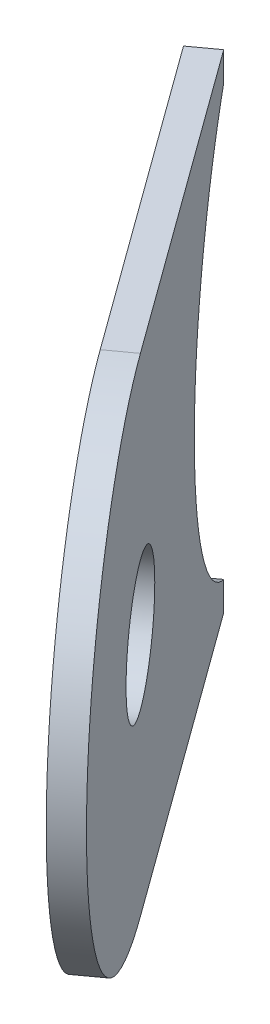
ISO-10303-21;
HEADER;
FILE_DESCRIPTION(('STEP AP214'),'2;1');
FILE_NAME('part.step','',(''),(''),'','','');
FILE_SCHEMA(('AUTOMOTIVE_DESIGN { 1 0 10303 214 1 1 1 1 }'));
ENDSEC;
DATA;
#1=APPLICATION_CONTEXT('core data for automotive mechanical design processes');
#2=APPLICATION_PROTOCOL_DEFINITION('international standard','automotive_design',2000,#1);
#3=PRODUCT_CONTEXT('',#1,'mechanical');
#4=PRODUCT('Part','Part','',(#3));
#5=PRODUCT_RELATED_PRODUCT_CATEGORY('part','',(#4));
#6=PRODUCT_DEFINITION_FORMATION('','',#4);
#7=PRODUCT_DEFINITION_CONTEXT('part definition',#1,'design');
#8=PRODUCT_DEFINITION('design','',#6,#7);
#9=PRODUCT_DEFINITION_SHAPE('','',#8);
#10=(LENGTH_UNIT() NAMED_UNIT(*) SI_UNIT(.MILLI.,.METRE.));
#11=(NAMED_UNIT(*) PLANE_ANGLE_UNIT() SI_UNIT($,.RADIAN.));
#12=(NAMED_UNIT(*) SI_UNIT($,.STERADIAN.) SOLID_ANGLE_UNIT());
#13=UNCERTAINTY_MEASURE_WITH_UNIT(LENGTH_MEASURE(1.E-05),#10,'distance_accuracy_value','');
#14=(GEOMETRIC_REPRESENTATION_CONTEXT(3) GLOBAL_UNCERTAINTY_ASSIGNED_CONTEXT((#13)) GLOBAL_UNIT_ASSIGNED_CONTEXT((#10,
#11,#12)) REPRESENTATION_CONTEXT('',''));
#15=CARTESIAN_POINT('',(0.,0.,0.));
#16=DIRECTION('',(0.,0.,1.));
#17=DIRECTION('',(1.,0.,0.));
#18=AXIS2_PLACEMENT_3D('',#15,#16,#17);
#19=CARTESIAN_POINT('',(19.2540689883157,294.,-217.024871090365));
#20=DIRECTION('',(0.809016994374949,0.,-0.587785252292471));
#21=DIRECTION('',(0.587785252292471,0.,0.809016994374949));
#22=AXIS2_PLACEMENT_3D('',#19,#20,#21);
#23=ELLIPSE('',#22,13.0903439582321,12.7);
#24=DIRECTION('',(-0.809016994374949,0.,0.587785252292471));
#25=VECTOR('',#24,1.);
#26=SURFACE_OF_LINEAR_EXTRUSION('',#23,#25);
#27=CARTESIAN_POINT('',(18.0405434967533,294.,-216.143193211926));
#28=DIRECTION('',(0.809016994374949,0.,-0.587785252292471));
#29=DIRECTION('',(0.587785252292471,0.,0.809016994374949));
#30=AXIS2_PLACEMENT_3D('',#27,#28,#29);
#31=ELLIPSE('',#30,13.0903439582321,12.7);
#32=CARTESIAN_POINT('',(21.6680700693378,305.2,-211.150331221392));
#33=VERTEX_POINT('',#32);
#34=CARTESIAN_POINT('',(21.6680700693377,282.8,-211.150331221392));
#35=VERTEX_POINT('',#34);
#36=EDGE_CURVE('E121',#33,#35,#31,.T.);
#37=ORIENTED_EDGE('',*,*,#36,.F.);
#38=DIRECTION('',(-0.809016994374949,0.,0.587785252292471));
#39=VECTOR('',#38,1.);
#40=CARTESIAN_POINT('',(22.8815955609002,305.2,-212.032009099831));
#41=LINE('',#40,#39);
#42=CARTESIAN_POINT('',(22.8815955609002,305.2,-212.032009099831));
#43=VERTEX_POINT('',#42);
#44=EDGE_CURVE('E11',#43,#33,#41,.T.);
#45=ORIENTED_EDGE('',*,*,#44,.F.);
#46=CARTESIAN_POINT('',(22.8815955609001,282.8,-212.032009099831));
#47=VERTEX_POINT('',#46);
#48=EDGE_CURVE('E137',#43,#47,#23,.T.);
#49=ORIENTED_EDGE('',*,*,#48,.T.);
#50=DIRECTION('',(-0.809016994374949,0.,0.587785252292471));
#51=VECTOR('',#50,1.);
#52=CARTESIAN_POINT('',(22.8815955609001,282.8,-212.032009099831));
#53=LINE('',#52,#51);
#54=EDGE_CURVE('E82',#47,#35,#53,.T.);
#55=ORIENTED_EDGE('',*,*,#54,.T.);
#56=EDGE_LOOP('',(#37,#45,#49,#55));
#57=FACE_BOUND('',#56,.T.);
#58=ADVANCED_FACE('F36',(#57),#26,.T.);
#59=CARTESIAN_POINT('',(22.8815955609002,0.,-212.032009099831));
#60=DIRECTION('',(-0.587785252292471,0.,-0.809016994374949));
#61=DIRECTION('',(-0.809016994374949,0.,0.587785252292471));
#62=AXIS2_PLACEMENT_3D('',#59,#60,#61);
#63=PLANE('',#62);
#64=DIRECTION('',(0.,-1.,0.));
#65=VECTOR('',#64,1.);
#66=CARTESIAN_POINT('',(21.6680700693378,0.,-211.150331221392));
#67=LINE('',#66,#65);
#68=CARTESIAN_POINT('',(21.6680700693378,306.7,-211.150331221392));
#69=VERTEX_POINT('',#68);
#70=EDGE_CURVE('E124',#69,#33,#67,.T.);
#71=ORIENTED_EDGE('',*,*,#70,.F.);
#72=DIRECTION('',(-0.809016994374949,0.,0.587785252292471));
#73=VECTOR('',#72,1.);
#74=CARTESIAN_POINT('',(22.8815955609002,306.7,-212.032009099831));
#75=LINE('',#74,#73);
#76=CARTESIAN_POINT('',(22.8815955609002,306.7,-212.032009099831));
#77=VERTEX_POINT('',#76);
#78=EDGE_CURVE('E45',#77,#69,#75,.T.);
#79=ORIENTED_EDGE('',*,*,#78,.F.);
#80=DIRECTION('',(0.,-1.,0.));
#81=VECTOR('',#80,1.);
#82=CARTESIAN_POINT('',(22.8815955609002,0.,-212.032009099831));
#83=LINE('',#82,#81);
#84=EDGE_CURVE('E153',#77,#43,#83,.T.);
#85=ORIENTED_EDGE('',*,*,#84,.T.);
#86=ORIENTED_EDGE('',*,*,#44,.T.);
#87=EDGE_LOOP('',(#71,#79,#85,#86));
#88=FACE_BOUND('',#87,.T.);
#89=ADVANCED_FACE('F146',(#88),#63,.T.);
#90=CARTESIAN_POINT('',(115.80341068259,306.7,-84.1361027489715));
#91=DIRECTION('',(0.,1.,0.));
#92=DIRECTION('',(-1.,0.,0.));
#93=AXIS2_PLACEMENT_3D('',#90,#91,#92);
#94=PLANE('',#93);
#95=DIRECTION('',(-0.587785252292471,0.,-0.809016994374949));
#96=VECTOR('',#95,1.);
#97=CARTESIAN_POINT('',(114.589885191028,306.7,-83.2544248705328));
#98=LINE('',#97,#96);
#99=CARTESIAN_POINT('',(33.1997273269524,306.7,-195.278366658941));
#100=VERTEX_POINT('',#99);
#101=EDGE_CURVE('E127',#100,#69,#98,.T.);
#102=ORIENTED_EDGE('',*,*,#101,.F.);
#103=DIRECTION('',(-0.809016994374949,0.,0.587785252292471));
#104=VECTOR('',#103,1.);
#105=CARTESIAN_POINT('',(34.4132528185149,306.7,-196.16004453738));
#106=LINE('',#105,#104);
#107=CARTESIAN_POINT('',(34.4132528185149,306.7,-196.16004453738));
#108=VERTEX_POINT('',#107);
#109=EDGE_CURVE('E110',#108,#100,#106,.T.);
#110=ORIENTED_EDGE('',*,*,#109,.F.);
#111=DIRECTION('',(-0.587785252292471,0.,-0.809016994374949));
#112=VECTOR('',#111,1.);
#113=CARTESIAN_POINT('',(115.80341068259,306.7,-84.1361027489715));
#114=LINE('',#113,#112);
#115=EDGE_CURVE('E103',#108,#77,#114,.T.);
#116=ORIENTED_EDGE('',*,*,#115,.T.);
#117=ORIENTED_EDGE('',*,*,#78,.T.);
#118=EDGE_LOOP('',(#102,#110,#116,#117));
#119=FACE_BOUND('',#118,.T.);
#120=ADVANCED_FACE('F143',(#119),#94,.T.);
#121=CARTESIAN_POINT('',(34.4132528185148,294.,-196.16004453738));
#122=DIRECTION('',(-0.809016994374949,0.,0.587785252292471));
#123=DIRECTION('',(0.587785252292471,0.,0.809016994374949));
#124=AXIS2_PLACEMENT_3D('',#121,#122,#123);
#125=CYLINDRICAL_SURFACE('',#124,12.7);
#126=CARTESIAN_POINT('',(33.1997273269524,294.,-195.278366658941));
#127=DIRECTION('',(0.809016994374949,0.,-0.587785252292471));
#128=DIRECTION('',(-0.587785252292471,0.,-0.809016994374949));
#129=AXIS2_PLACEMENT_3D('',#126,#127,#128);
#130=CIRCLE('',#129,12.7);
#131=CARTESIAN_POINT('',(33.1997273269524,281.3,-195.278366658941));
#132=VERTEX_POINT('',#131);
#133=EDGE_CURVE('E109',#100,#132,#130,.T.);
#134=ORIENTED_EDGE('',*,*,#133,.T.);
#135=DIRECTION('',(-0.809016994374949,0.,0.587785252292471));
#136=VECTOR('',#135,1.);
#137=CARTESIAN_POINT('',(34.4132528185149,281.3,-196.16004453738));
#138=LINE('',#137,#136);
#139=CARTESIAN_POINT('',(34.4132528185149,281.3,-196.16004453738));
#140=VERTEX_POINT('',#139);
#141=EDGE_CURVE('E106',#140,#132,#138,.T.);
#142=ORIENTED_EDGE('',*,*,#141,.F.);
#143=CARTESIAN_POINT('',(34.4132528185148,294.,-196.16004453738));
#144=DIRECTION('',(0.809016994374949,0.,-0.587785252292471));
#145=DIRECTION('',(-0.587785252292471,0.,-0.809016994374949));
#146=AXIS2_PLACEMENT_3D('',#143,#144,#145);
#147=CIRCLE('',#146,12.7);
#148=EDGE_CURVE('E95',#108,#140,#147,.T.);
#149=ORIENTED_EDGE('',*,*,#148,.F.);
#150=ORIENTED_EDGE('',*,*,#109,.T.);
#151=EDGE_LOOP('',(#134,#142,#149,#150));
#152=FACE_BOUND('',#151,.T.);
#153=ADVANCED_FACE('F107',(#152),#125,.T.);
#154=CARTESIAN_POINT('',(115.80341068259,281.3,-84.1361027489715));
#155=DIRECTION('',(0.,1.,0.));
#156=DIRECTION('',(-1.,0.,0.));
#157=AXIS2_PLACEMENT_3D('',#154,#155,#156);
#158=PLANE('',#157);
#159=DIRECTION('',(-0.587785252292471,0.,-0.809016994374949));
#160=VECTOR('',#159,1.);
#161=CARTESIAN_POINT('',(114.589885191028,281.3,-83.2544248705328));
#162=LINE('',#161,#160);
#163=CARTESIAN_POINT('',(21.6680700693377,281.3,-211.150331221392));
#164=VERTEX_POINT('',#163);
#165=EDGE_CURVE('E75',#132,#164,#162,.T.);
#166=ORIENTED_EDGE('',*,*,#165,.T.);
#167=DIRECTION('',(-0.809016994374949,0.,0.587785252292471));
#168=VECTOR('',#167,1.);
#169=CARTESIAN_POINT('',(22.8815955609002,281.3,-212.032009099831));
#170=LINE('',#169,#168);
#171=CARTESIAN_POINT('',(22.8815955609002,281.3,-212.032009099831));
#172=VERTEX_POINT('',#171);
#173=EDGE_CURVE('E111',#172,#164,#170,.T.);
#174=ORIENTED_EDGE('',*,*,#173,.F.);
#175=DIRECTION('',(-0.587785252292471,0.,-0.809016994374949));
#176=VECTOR('',#175,1.);
#177=CARTESIAN_POINT('',(115.80341068259,281.3,-84.1361027489715));
#178=LINE('',#177,#176);
#179=EDGE_CURVE('E100',#140,#172,#178,.T.);
#180=ORIENTED_EDGE('',*,*,#179,.F.);
#181=ORIENTED_EDGE('',*,*,#141,.T.);
#182=EDGE_LOOP('',(#166,#174,#180,#181));
#183=FACE_BOUND('',#182,.T.);
#184=ADVANCED_FACE('F113',(#183),#158,.F.);
#185=CARTESIAN_POINT('',(22.8815955609146,-1.37844868923129E-11,-212.032009099811));
#186=DIRECTION('',(0.587785252292471,0.,0.809016994374949));
#187=DIRECTION('',(0.809016994374949,0.,-0.587785252292471));
#188=AXIS2_PLACEMENT_3D('',#185,#186,#187);
#189=PLANE('',#188);
#190=DIRECTION('',(0.,1.,0.));
#191=VECTOR('',#190,1.);
#192=CARTESIAN_POINT('',(21.6680700693521,-1.37843527308205E-11,-211.150331221372));
#193=LINE('',#192,#191);
#194=EDGE_CURVE('E132',#164,#35,#193,.T.);
#195=ORIENTED_EDGE('',*,*,#194,.T.);
#196=ORIENTED_EDGE('',*,*,#54,.F.);
#197=DIRECTION('',(0.,1.,0.));
#198=VECTOR('',#197,1.);
#199=CARTESIAN_POINT('',(22.8815955609146,-1.37844868923129E-11,-212.032009099811));
#200=LINE('',#199,#198);
#201=EDGE_CURVE('E53',#172,#47,#200,.T.);
#202=ORIENTED_EDGE('',*,*,#201,.F.);
#203=ORIENTED_EDGE('',*,*,#173,.T.);
#204=EDGE_LOOP('',(#195,#196,#202,#203));
#205=FACE_BOUND('',#204,.T.);
#206=ADVANCED_FACE('F152',(#205),#189,.F.);
#207=CARTESIAN_POINT('',(34.4132528185148,294.,-196.16004453738));
#208=DIRECTION('',(-0.809016994374949,0.,0.587785252292471));
#209=DIRECTION('',(0.587785252292471,0.,0.809016994374949));
#210=AXIS2_PLACEMENT_3D('',#207,#208,#209);
#211=CYLINDRICAL_SURFACE('',#210,3.3782);
#212=CARTESIAN_POINT('',(34.4132528185148,294.,-196.16004453738));
#213=DIRECTION('',(0.809016994374949,0.,-0.587785252292471));
#214=DIRECTION('',(-0.587785252292471,0.,-0.809016994374949));
#215=AXIS2_PLACEMENT_3D('',#212,#213,#214);
#216=CIRCLE('',#215,3.3782);
#217=CARTESIAN_POINT('',(32.4275966792204,294.,-198.893065747777));
#218=VERTEX_POINT('',#217);
#219=EDGE_CURVE('E115',#218,#218,#216,.T.);
#220=ORIENTED_EDGE('',*,*,#219,.T.);
#221=EDGE_LOOP('',(#220));
#222=FACE_BOUND('',#221,.T.);
#223=CARTESIAN_POINT('',(33.1997273269524,294.,-195.278366658941));
#224=DIRECTION('',(0.809016994374949,0.,-0.587785252292471));
#225=DIRECTION('',(-0.587785252292471,0.,-0.809016994374949));
#226=AXIS2_PLACEMENT_3D('',#223,#224,#225);
#227=CIRCLE('',#226,3.3782);
#228=CARTESIAN_POINT('',(31.214071187658,294.,-198.011387869338));
#229=VERTEX_POINT('',#228);
#230=EDGE_CURVE('E134',#229,#229,#227,.T.);
#231=ORIENTED_EDGE('',*,*,#230,.F.);
#232=EDGE_LOOP('',(#231));
#233=FACE_BOUND('',#232,.T.);
#234=ADVANCED_FACE('F171',(#222,#233),#211,.F.);
#235=CARTESIAN_POINT('',(115.80341068259,0.,-84.1361027489715));
#236=DIRECTION('',(0.809016994374949,0.,-0.587785252292471));
#237=DIRECTION('',(-0.587785252292471,0.,-0.809016994374949));
#238=AXIS2_PLACEMENT_3D('',#235,#236,#237);
#239=PLANE('',#238);
#240=ORIENTED_EDGE('',*,*,#48,.F.);
#241=ORIENTED_EDGE('',*,*,#84,.F.);
#242=ORIENTED_EDGE('',*,*,#115,.F.);
#243=ORIENTED_EDGE('',*,*,#148,.T.);
#244=ORIENTED_EDGE('',*,*,#179,.T.);
#245=ORIENTED_EDGE('',*,*,#201,.T.);
#246=EDGE_LOOP('',(#240,#241,#242,#243,#244,#245));
#247=FACE_BOUND('',#246,.T.);
#248=ORIENTED_EDGE('',*,*,#219,.F.);
#249=EDGE_LOOP('',(#248));
#250=FACE_BOUND('',#249,.T.);
#251=ADVANCED_FACE('F97',(#247,#250),#239,.T.);
#252=CARTESIAN_POINT('',(114.589885191027,0.,-83.2544248705328));
#253=DIRECTION('',(0.809016994374949,0.,-0.587785252292471));
#254=DIRECTION('',(-0.587785252292471,0.,-0.809016994374949));
#255=AXIS2_PLACEMENT_3D('',#252,#253,#254);
#256=PLANE('',#255);
#257=ORIENTED_EDGE('',*,*,#36,.T.);
#258=ORIENTED_EDGE('',*,*,#194,.F.);
#259=ORIENTED_EDGE('',*,*,#165,.F.);
#260=ORIENTED_EDGE('',*,*,#133,.F.);
#261=ORIENTED_EDGE('',*,*,#101,.T.);
#262=ORIENTED_EDGE('',*,*,#70,.T.);
#263=EDGE_LOOP('',(#257,#258,#259,#260,#261,#262));
#264=FACE_BOUND('',#263,.T.);
#265=ORIENTED_EDGE('',*,*,#230,.T.);
#266=EDGE_LOOP('',(#265));
#267=FACE_BOUND('',#266,.T.);
#268=ADVANCED_FACE('F148',(#264,#267),#256,.F.);
#269=CLOSED_SHELL('',(#58,#89,#120,#153,#184,#206,#234,#251,#268));
#270=MANIFOLD_SOLID_BREP('B2',#269);
#271=ADVANCED_BREP_SHAPE_REPRESENTATION('',(#18,#270),#14);
#272=SHAPE_DEFINITION_REPRESENTATION(#9,#271);
ENDSEC;
END-ISO-10303-21;
